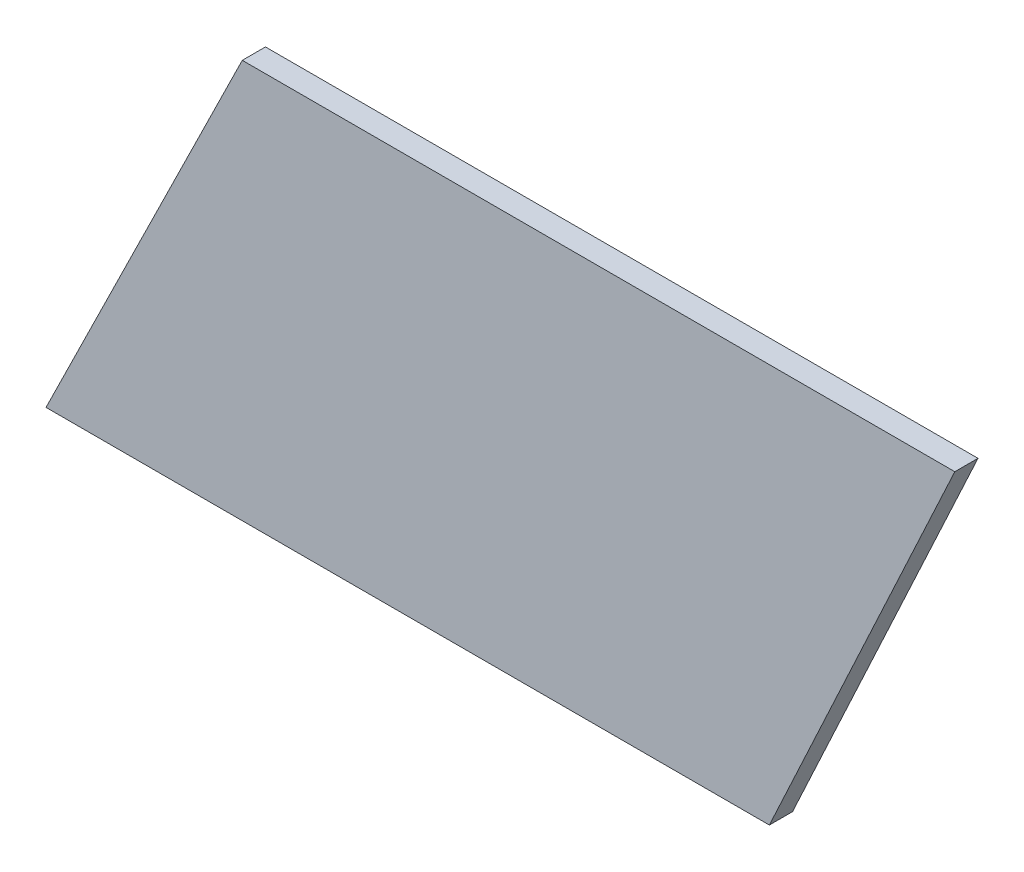
ISO-10303-21;
HEADER;
FILE_DESCRIPTION(('STEP AP214'),'2;1');
FILE_NAME('part.step','',(''),(''),'','','');
FILE_SCHEMA(('AUTOMOTIVE_DESIGN { 1 0 10303 214 1 1 1 1 }'));
ENDSEC;
DATA;
#1=APPLICATION_CONTEXT('core data for automotive mechanical design processes');
#2=APPLICATION_PROTOCOL_DEFINITION('international standard','automotive_design',2000,#1);
#3=PRODUCT_CONTEXT('',#1,'mechanical');
#4=PRODUCT('Part','Part','',(#3));
#5=PRODUCT_RELATED_PRODUCT_CATEGORY('part','',(#4));
#6=PRODUCT_DEFINITION_FORMATION('','',#4);
#7=PRODUCT_DEFINITION_CONTEXT('part definition',#1,'design');
#8=PRODUCT_DEFINITION('design','',#6,#7);
#9=PRODUCT_DEFINITION_SHAPE('','',#8);
#10=(LENGTH_UNIT() NAMED_UNIT(*) SI_UNIT(.MILLI.,.METRE.));
#11=(NAMED_UNIT(*) PLANE_ANGLE_UNIT() SI_UNIT($,.RADIAN.));
#12=(NAMED_UNIT(*) SI_UNIT($,.STERADIAN.) SOLID_ANGLE_UNIT());
#13=UNCERTAINTY_MEASURE_WITH_UNIT(LENGTH_MEASURE(1.E-05),#10,'distance_accuracy_value','');
#14=(GEOMETRIC_REPRESENTATION_CONTEXT(3) GLOBAL_UNCERTAINTY_ASSIGNED_CONTEXT((#13)) GLOBAL_UNIT_ASSIGNED_CONTEXT((#10,
#11,#12)) REPRESENTATION_CONTEXT('',''));
#15=CARTESIAN_POINT('',(0.,0.,0.));
#16=DIRECTION('',(0.,0.,1.));
#17=DIRECTION('',(1.,0.,0.));
#18=AXIS2_PLACEMENT_3D('',#15,#16,#17);
#19=CARTESIAN_POINT('',(0.,15.245,0.75));
#20=DIRECTION('',(-0.906721111888507,0.421730749715585,0.));
#21=DIRECTION('',(-0.421730749715585,-0.906721111888507,0.));
#22=AXIS2_PLACEMENT_3D('',#19,#20,#21);
#23=PLANE('',#22);
#24=DIRECTION('',(0.421730749715585,0.906721111888507,0.));
#25=VECTOR('',#24,1.);
#26=CARTESIAN_POINT('',(0.,15.245,-0.75));
#27=LINE('',#26,#25);
#28=CARTESIAN_POINT('',(0.,15.245,-0.75));
#29=VERTEX_POINT('',#28);
#30=CARTESIAN_POINT('',(12.,41.045,-0.75));
#31=VERTEX_POINT('',#30);
#32=EDGE_CURVE('E80',#29,#31,#27,.T.);
#33=ORIENTED_EDGE('',*,*,#32,.T.);
#34=DIRECTION('',(0.,0.,-1.));
#35=VECTOR('',#34,1.);
#36=CARTESIAN_POINT('',(12.,41.045,0.75));
#37=LINE('',#36,#35);
#38=CARTESIAN_POINT('',(12.,41.045,0.75));
#39=VERTEX_POINT('',#38);
#40=EDGE_CURVE('E75',#39,#31,#37,.T.);
#41=ORIENTED_EDGE('',*,*,#40,.F.);
#42=DIRECTION('',(0.421730749715585,0.906721111888507,0.));
#43=VECTOR('',#42,1.);
#44=CARTESIAN_POINT('',(0.,15.245,0.75));
#45=LINE('',#44,#43);
#46=CARTESIAN_POINT('',(0.,15.245,0.75));
#47=VERTEX_POINT('',#46);
#48=EDGE_CURVE('E91',#47,#39,#45,.T.);
#49=ORIENTED_EDGE('',*,*,#48,.F.);
#50=DIRECTION('',(0.,0.,-1.));
#51=VECTOR('',#50,1.);
#52=CARTESIAN_POINT('',(0.,15.245,0.75));
#53=LINE('',#52,#51);
#54=EDGE_CURVE('E97',#47,#29,#53,.T.);
#55=ORIENTED_EDGE('',*,*,#54,.T.);
#56=EDGE_LOOP('',(#33,#41,#49,#55));
#57=FACE_BOUND('',#56,.T.);
#58=ADVANCED_FACE('F33',(#57),#23,.F.);
#59=CARTESIAN_POINT('',(12.,41.045,0.75));
#60=DIRECTION('',(0.,-1.,0.));
#61=DIRECTION('',(1.,0.,0.));
#62=AXIS2_PLACEMENT_3D('',#59,#60,#61);
#63=PLANE('',#62);
#64=DIRECTION('',(-1.,0.,0.));
#65=VECTOR('',#64,1.);
#66=CARTESIAN_POINT('',(12.,41.045,-0.75));
#67=LINE('',#66,#65);
#68=CARTESIAN_POINT('',(-34.1,41.045,-0.75));
#69=VERTEX_POINT('',#68);
#70=EDGE_CURVE('E69',#31,#69,#67,.T.);
#71=ORIENTED_EDGE('',*,*,#70,.T.);
#72=DIRECTION('',(0.,0.,-1.));
#73=VECTOR('',#72,1.);
#74=CARTESIAN_POINT('',(-34.1,41.045,0.75));
#75=LINE('',#74,#73);
#76=CARTESIAN_POINT('',(-34.1,41.045,0.75));
#77=VERTEX_POINT('',#76);
#78=EDGE_CURVE('E72',#77,#69,#75,.T.);
#79=ORIENTED_EDGE('',*,*,#78,.F.);
#80=DIRECTION('',(-1.,0.,0.));
#81=VECTOR('',#80,1.);
#82=CARTESIAN_POINT('',(12.,41.045,0.75));
#83=LINE('',#82,#81);
#84=EDGE_CURVE('E56',#39,#77,#83,.T.);
#85=ORIENTED_EDGE('',*,*,#84,.F.);
#86=ORIENTED_EDGE('',*,*,#40,.T.);
#87=EDGE_LOOP('',(#71,#79,#85,#86));
#88=FACE_BOUND('',#87,.T.);
#89=ADVANCED_FACE('F71',(#88),#63,.F.);
#90=CARTESIAN_POINT('',(-34.1,41.045,0.75));
#91=DIRECTION('',(0.897191875161841,-0.441640961804472,0.));
#92=DIRECTION('',(0.441640961804473,0.897191875161841,0.));
#93=AXIS2_PLACEMENT_3D('',#90,#91,#92);
#94=PLANE('',#93);
#95=DIRECTION('',(-0.441640961804472,-0.897191875161841,0.));
#96=VECTOR('',#95,1.);
#97=CARTESIAN_POINT('',(-34.1,41.045,-0.75));
#98=LINE('',#97,#96);
#99=CARTESIAN_POINT('',(-46.7992299433287,15.246564367096,-0.75));
#100=VERTEX_POINT('',#99);
#101=EDGE_CURVE('E79',#69,#100,#98,.T.);
#102=ORIENTED_EDGE('',*,*,#101,.T.);
#103=CARTESIAN_POINT('',(-54.3043217054264,0.,0.));
#104=DIRECTION('',(0.897191875161841,-0.441640961804472,0.));
#105=DIRECTION('',(0.441640961804472,0.897191875161841,0.));
#106=AXIS2_PLACEMENT_3D('',#103,#104,#105);
#107=ELLIPSE('',#106,17.0141977681713,15.265);
#108=CARTESIAN_POINT('',(-46.7992299433287,15.2465643670959,0.75));
#109=VERTEX_POINT('',#108);
#110=EDGE_CURVE('E115',#100,#109,#107,.T.);
#111=ORIENTED_EDGE('',*,*,#110,.T.);
#112=DIRECTION('',(-0.441640961804472,-0.897191875161841,0.));
#113=VECTOR('',#112,1.);
#114=CARTESIAN_POINT('',(-34.1,41.045,0.75));
#115=LINE('',#114,#113);
#116=EDGE_CURVE('E87',#77,#109,#115,.T.);
#117=ORIENTED_EDGE('',*,*,#116,.F.);
#118=ORIENTED_EDGE('',*,*,#78,.T.);
#119=EDGE_LOOP('',(#102,#111,#117,#118));
#120=FACE_BOUND('',#119,.T.);
#121=ADVANCED_FACE('F84',(#120),#94,.F.);
#122=CARTESIAN_POINT('',(0.,0.,0.75));
#123=DIRECTION('',(0.,0.,1.));
#124=DIRECTION('',(1.,0.,0.));
#125=AXIS2_PLACEMENT_3D('',#122,#123,#124);
#126=PLANE('',#125);
#127=DIRECTION('',(1.,0.,0.));
#128=VECTOR('',#127,1.);
#129=CARTESIAN_POINT('',(-46.8,15.246564367096,0.75));
#130=LINE('',#129,#128);
#131=CARTESIAN_POINT('',(0.,15.246564367096,0.75));
#132=VERTEX_POINT('',#131);
#133=EDGE_CURVE('E113',#132,#109,#130,.F.);
#134=ORIENTED_EDGE('',*,*,#133,.F.);
#135=DIRECTION('',(0.,1.,0.));
#136=VECTOR('',#135,1.);
#137=CARTESIAN_POINT('',(0.,0.,0.75));
#138=LINE('',#137,#136);
#139=EDGE_CURVE('E117',#47,#132,#138,.T.);
#140=ORIENTED_EDGE('',*,*,#139,.F.);
#141=ORIENTED_EDGE('',*,*,#48,.T.);
#142=ORIENTED_EDGE('',*,*,#84,.T.);
#143=ORIENTED_EDGE('',*,*,#116,.T.);
#144=EDGE_LOOP('',(#134,#140,#141,#142,#143));
#145=FACE_BOUND('',#144,.T.);
#146=ADVANCED_FACE('F119',(#145),#126,.T.);
#147=CARTESIAN_POINT('',(0.,0.,-0.75));
#148=DIRECTION('',(0.,0.,1.));
#149=DIRECTION('',(1.,0.,0.));
#150=AXIS2_PLACEMENT_3D('',#147,#148,#149);
#151=PLANE('',#150);
#152=DIRECTION('',(0.,1.,0.));
#153=VECTOR('',#152,1.);
#154=CARTESIAN_POINT('',(0.,0.,-0.75));
#155=LINE('',#154,#153);
#156=CARTESIAN_POINT('',(0.,15.246564367096,-0.75));
#157=VERTEX_POINT('',#156);
#158=EDGE_CURVE('E40',#29,#157,#155,.T.);
#159=ORIENTED_EDGE('',*,*,#158,.T.);
#160=DIRECTION('',(1.,0.,0.));
#161=VECTOR('',#160,1.);
#162=CARTESIAN_POINT('',(-46.8,15.246564367096,-0.75));
#163=LINE('',#162,#161);
#164=EDGE_CURVE('E11',#157,#100,#163,.F.);
#165=ORIENTED_EDGE('',*,*,#164,.T.);
#166=ORIENTED_EDGE('',*,*,#101,.F.);
#167=ORIENTED_EDGE('',*,*,#70,.F.);
#168=ORIENTED_EDGE('',*,*,#32,.F.);
#169=EDGE_LOOP('',(#159,#165,#166,#167,#168));
#170=FACE_BOUND('',#169,.T.);
#171=ADVANCED_FACE('F90',(#170),#151,.F.);
#172=CARTESIAN_POINT('',(-46.8,0.,0.));
#173=DIRECTION('',(1.,0.,0.));
#174=DIRECTION('',(0.,0.,-1.));
#175=AXIS2_PLACEMENT_3D('',#172,#173,#174);
#176=CYLINDRICAL_SURFACE('',#175,15.265);
#177=ORIENTED_EDGE('',*,*,#133,.T.);
#178=ORIENTED_EDGE('',*,*,#110,.F.);
#179=ORIENTED_EDGE('',*,*,#164,.F.);
#180=CARTESIAN_POINT('',(0.,0.,0.));
#181=DIRECTION('',(1.,0.,0.));
#182=DIRECTION('',(0.,0.,-1.));
#183=AXIS2_PLACEMENT_3D('',#180,#181,#182);
#184=CIRCLE('',#183,15.265);
#185=EDGE_CURVE('E47',#157,#132,#184,.T.);
#186=ORIENTED_EDGE('',*,*,#185,.T.);
#187=EDGE_LOOP('',(#177,#178,#179,#186));
#188=FACE_BOUND('',#187,.T.);
#189=ADVANCED_FACE('F114',(#188),#176,.F.);
#190=CARTESIAN_POINT('',(0.,0.,0.));
#191=DIRECTION('',(1.,0.,0.));
#192=DIRECTION('',(0.,0.,-1.));
#193=AXIS2_PLACEMENT_3D('',#190,#191,#192);
#194=PLANE('',#193);
#195=ORIENTED_EDGE('',*,*,#139,.T.);
#196=ORIENTED_EDGE('',*,*,#185,.F.);
#197=ORIENTED_EDGE('',*,*,#158,.F.);
#198=ORIENTED_EDGE('',*,*,#54,.F.);
#199=EDGE_LOOP('',(#195,#196,#197,#198));
#200=FACE_BOUND('',#199,.T.);
#201=ADVANCED_FACE('F101',(#200),#194,.F.);
#202=CLOSED_SHELL('',(#58,#89,#121,#146,#171,#189,#201));
#203=MANIFOLD_SOLID_BREP('B2',#202);
#204=ADVANCED_BREP_SHAPE_REPRESENTATION('',(#18,#203),#14);
#205=SHAPE_DEFINITION_REPRESENTATION(#9,#204);
ENDSEC;
END-ISO-10303-21;
